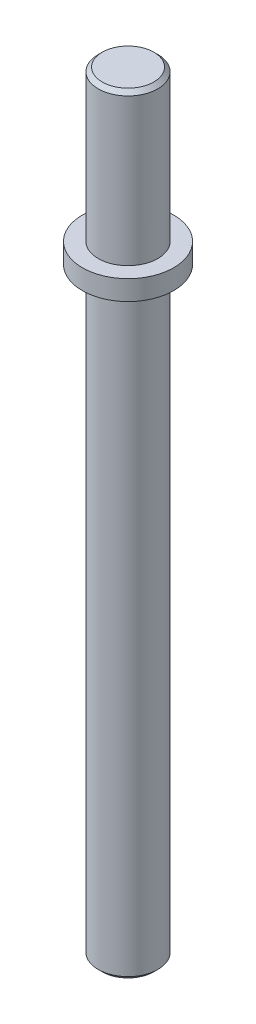
ISO-10303-21;
HEADER;
FILE_DESCRIPTION(('STEP AP214'),'2;1');
FILE_NAME('part.step','',(''),(''),'','','');
FILE_SCHEMA(('AUTOMOTIVE_DESIGN { 1 0 10303 214 1 1 1 1 }'));
ENDSEC;
DATA;
#1=APPLICATION_CONTEXT('core data for automotive mechanical design processes');
#2=APPLICATION_PROTOCOL_DEFINITION('international standard','automotive_design',2000,#1);
#3=PRODUCT_CONTEXT('',#1,'mechanical');
#4=PRODUCT('Part','Part','',(#3));
#5=PRODUCT_RELATED_PRODUCT_CATEGORY('part','',(#4));
#6=PRODUCT_DEFINITION_FORMATION('','',#4);
#7=PRODUCT_DEFINITION_CONTEXT('part definition',#1,'design');
#8=PRODUCT_DEFINITION('design','',#6,#7);
#9=PRODUCT_DEFINITION_SHAPE('','',#8);
#10=(LENGTH_UNIT() NAMED_UNIT(*) SI_UNIT(.MILLI.,.METRE.));
#11=(NAMED_UNIT(*) PLANE_ANGLE_UNIT() SI_UNIT($,.RADIAN.));
#12=(NAMED_UNIT(*) SI_UNIT($,.STERADIAN.) SOLID_ANGLE_UNIT());
#13=UNCERTAINTY_MEASURE_WITH_UNIT(LENGTH_MEASURE(1.E-05),#10,'distance_accuracy_value','');
#14=(GEOMETRIC_REPRESENTATION_CONTEXT(3) GLOBAL_UNCERTAINTY_ASSIGNED_CONTEXT((#13)) GLOBAL_UNIT_ASSIGNED_CONTEXT((#10,
#11,#12)) REPRESENTATION_CONTEXT('',''));
#15=CARTESIAN_POINT('',(0.,0.,0.));
#16=DIRECTION('',(0.,0.,1.));
#17=DIRECTION('',(1.,0.,0.));
#18=AXIS2_PLACEMENT_3D('',#15,#16,#17);
#19=CARTESIAN_POINT('',(0.,-35.306,0.));
#20=DIRECTION('',(0.,-1.,0.));
#21=DIRECTION('',(0.,0.,-1.));
#22=AXIS2_PLACEMENT_3D('',#19,#20,#21);
#23=PLANE('',#22);
#24=CARTESIAN_POINT('',(0.,-35.306,0.));
#25=DIRECTION('',(0.,-1.,0.));
#26=DIRECTION('',(0.,0.,-1.));
#27=AXIS2_PLACEMENT_3D('',#24,#25,#26);
#28=CIRCLE('',#27,1.65100000000001);
#29=CARTESIAN_POINT('',(0.,-35.306,-1.65100000000001));
#30=VERTEX_POINT('',#29);
#31=EDGE_CURVE('E47',#30,#30,#28,.T.);
#32=ORIENTED_EDGE('',*,*,#31,.T.);
#33=EDGE_LOOP('',(#32));
#34=FACE_BOUND('',#33,.T.);
#35=ADVANCED_FACE('F32',(#34),#23,.T.);
#36=CARTESIAN_POINT('',(0.,0.,0.));
#37=DIRECTION('',(0.,-1.,0.));
#38=DIRECTION('',(0.,0.,-1.));
#39=AXIS2_PLACEMENT_3D('',#36,#37,#38);
#40=CYLINDRICAL_SURFACE('',#39,1.905);
#41=CARTESIAN_POINT('',(0.,-35.052,0.));
#42=DIRECTION('',(0.,-1.,0.));
#43=DIRECTION('',(0.,0.,-1.));
#44=AXIS2_PLACEMENT_3D('',#41,#42,#43);
#45=CIRCLE('',#44,1.905);
#46=CARTESIAN_POINT('',(0.,-35.052,-1.905));
#47=VERTEX_POINT('',#46);
#48=EDGE_CURVE('E43',#47,#47,#45,.F.);
#49=ORIENTED_EDGE('',*,*,#48,.T.);
#50=EDGE_LOOP('',(#49));
#51=FACE_BOUND('',#50,.T.);
#52=CARTESIAN_POINT('',(0.,3.048,0.));
#53=DIRECTION('',(0.,-1.,0.));
#54=DIRECTION('',(0.,0.,-1.));
#55=AXIS2_PLACEMENT_3D('',#52,#53,#54);
#56=CIRCLE('',#55,1.905);
#57=CARTESIAN_POINT('',(0.,3.048,-1.905));
#58=VERTEX_POINT('',#57);
#59=EDGE_CURVE('E52',#58,#58,#56,.T.);
#60=ORIENTED_EDGE('',*,*,#59,.T.);
#61=EDGE_LOOP('',(#60));
#62=FACE_BOUND('',#61,.T.);
#63=ADVANCED_FACE('F81',(#51,#62),#40,.T.);
#64=CARTESIAN_POINT('',(1.905,3.048,0.));
#65=DIRECTION('',(0.,-1.,0.));
#66=DIRECTION('',(0.,0.,-1.));
#67=AXIS2_PLACEMENT_3D('',#64,#65,#66);
#68=PLANE('',#67);
#69=CARTESIAN_POINT('',(0.,3.048,0.));
#70=DIRECTION('',(0.,-1.,0.));
#71=DIRECTION('',(0.,0.,-1.));
#72=AXIS2_PLACEMENT_3D('',#69,#70,#71);
#73=CIRCLE('',#72,2.921);
#74=CARTESIAN_POINT('',(0.,3.048,-2.921));
#75=VERTEX_POINT('',#74);
#76=EDGE_CURVE('E55',#75,#75,#73,.T.);
#77=ORIENTED_EDGE('',*,*,#76,.T.);
#78=EDGE_LOOP('',(#77));
#79=FACE_BOUND('',#78,.T.);
#80=ORIENTED_EDGE('',*,*,#59,.F.);
#81=EDGE_LOOP('',(#80));
#82=FACE_BOUND('',#81,.T.);
#83=ADVANCED_FACE('F87',(#79,#82),#68,.T.);
#84=CARTESIAN_POINT('',(0.,0.,0.));
#85=DIRECTION('',(0.,-1.,0.));
#86=DIRECTION('',(0.,0.,-1.));
#87=AXIS2_PLACEMENT_3D('',#84,#85,#86);
#88=CYLINDRICAL_SURFACE('',#87,2.921);
#89=CARTESIAN_POINT('',(0.,4.318,0.));
#90=DIRECTION('',(0.,-1.,0.));
#91=DIRECTION('',(0.,0.,-1.));
#92=AXIS2_PLACEMENT_3D('',#89,#90,#91);
#93=CIRCLE('',#92,2.921);
#94=CARTESIAN_POINT('',(0.,4.318,-2.921));
#95=VERTEX_POINT('',#94);
#96=EDGE_CURVE('E58',#95,#95,#93,.T.);
#97=ORIENTED_EDGE('',*,*,#96,.T.);
#98=EDGE_LOOP('',(#97));
#99=FACE_BOUND('',#98,.T.);
#100=ORIENTED_EDGE('',*,*,#76,.F.);
#101=EDGE_LOOP('',(#100));
#102=FACE_BOUND('',#101,.T.);
#103=ADVANCED_FACE('F78',(#99,#102),#88,.T.);
#104=CARTESIAN_POINT('',(1.905,4.318,0.));
#105=DIRECTION('',(0.,1.,0.));
#106=DIRECTION('',(0.,0.,1.));
#107=AXIS2_PLACEMENT_3D('',#104,#105,#106);
#108=PLANE('',#107);
#109=CARTESIAN_POINT('',(0.,4.318,0.));
#110=DIRECTION('',(0.,-1.,0.));
#111=DIRECTION('',(0.,0.,-1.));
#112=AXIS2_PLACEMENT_3D('',#109,#110,#111);
#113=CIRCLE('',#112,1.905);
#114=CARTESIAN_POINT('',(0.,4.318,-1.905));
#115=VERTEX_POINT('',#114);
#116=EDGE_CURVE('E61',#115,#115,#113,.T.);
#117=ORIENTED_EDGE('',*,*,#116,.T.);
#118=EDGE_LOOP('',(#117));
#119=FACE_BOUND('',#118,.T.);
#120=ORIENTED_EDGE('',*,*,#96,.F.);
#121=EDGE_LOOP('',(#120));
#122=FACE_BOUND('',#121,.T.);
#123=ADVANCED_FACE('F65',(#119,#122),#108,.T.);
#124=CARTESIAN_POINT('',(0.,0.,0.));
#125=DIRECTION('',(0.,-1.,0.));
#126=DIRECTION('',(0.,0.,-1.));
#127=AXIS2_PLACEMENT_3D('',#124,#125,#126);
#128=CYLINDRICAL_SURFACE('',#127,1.905);
#129=CARTESIAN_POINT('',(0.,13.716,0.));
#130=DIRECTION('',(0.,1.,0.));
#131=DIRECTION('',(0.,0.,1.));
#132=AXIS2_PLACEMENT_3D('',#129,#130,#131);
#133=CIRCLE('',#132,1.905);
#134=CARTESIAN_POINT('',(0.,13.716,1.905));
#135=VERTEX_POINT('',#134);
#136=EDGE_CURVE('E39',#135,#135,#133,.F.);
#137=ORIENTED_EDGE('',*,*,#136,.T.);
#138=EDGE_LOOP('',(#137));
#139=FACE_BOUND('',#138,.T.);
#140=ORIENTED_EDGE('',*,*,#116,.F.);
#141=EDGE_LOOP('',(#140));
#142=FACE_BOUND('',#141,.T.);
#143=ADVANCED_FACE('F68',(#139,#142),#128,.T.);
#144=CARTESIAN_POINT('',(0.,13.97,0.));
#145=DIRECTION('',(0.,1.,0.));
#146=DIRECTION('',(0.,0.,1.));
#147=AXIS2_PLACEMENT_3D('',#144,#145,#146);
#148=PLANE('',#147);
#149=CARTESIAN_POINT('',(0.,13.97,0.));
#150=DIRECTION('',(0.,1.,0.));
#151=DIRECTION('',(0.,0.,1.));
#152=AXIS2_PLACEMENT_3D('',#149,#150,#151);
#153=CIRCLE('',#152,1.65099999999999);
#154=CARTESIAN_POINT('',(0.,13.97,1.65099999999999));
#155=VERTEX_POINT('',#154);
#156=EDGE_CURVE('E10',#155,#155,#153,.T.);
#157=ORIENTED_EDGE('',*,*,#156,.T.);
#158=EDGE_LOOP('',(#157));
#159=FACE_BOUND('',#158,.T.);
#160=ADVANCED_FACE('F70',(#159),#148,.T.);
#161=CARTESIAN_POINT('',(0.,-35.306,0.));
#162=DIRECTION('',(0.,1.,0.));
#163=DIRECTION('',(0.,0.,1.));
#164=AXIS2_PLACEMENT_3D('',#161,#162,#163);
#165=CONICAL_SURFACE('',#164,1.65100000000001,0.785398163397436);
#166=ORIENTED_EDGE('',*,*,#48,.F.);
#167=EDGE_LOOP('',(#166));
#168=FACE_BOUND('',#167,.T.);
#169=ORIENTED_EDGE('',*,*,#31,.F.);
#170=EDGE_LOOP('',(#169));
#171=FACE_BOUND('',#170,.T.);
#172=ADVANCED_FACE('F76',(#168,#171),#165,.T.);
#173=CARTESIAN_POINT('',(0.,13.716,0.));
#174=DIRECTION('',(0.,-1.,0.));
#175=DIRECTION('',(0.,0.,-1.));
#176=AXIS2_PLACEMENT_3D('',#173,#174,#175);
#177=CONICAL_SURFACE('',#176,1.905,0.785398163397445);
#178=ORIENTED_EDGE('',*,*,#156,.F.);
#179=EDGE_LOOP('',(#178));
#180=FACE_BOUND('',#179,.T.);
#181=ORIENTED_EDGE('',*,*,#136,.F.);
#182=EDGE_LOOP('',(#181));
#183=FACE_BOUND('',#182,.T.);
#184=ADVANCED_FACE('F34',(#180,#183),#177,.T.);
#185=CLOSED_SHELL('',(#35,#63,#83,#103,#123,#143,#160,#172,#184));
#186=MANIFOLD_SOLID_BREP('B2',#185);
#187=ADVANCED_BREP_SHAPE_REPRESENTATION('',(#18,#186),#14);
#188=SHAPE_DEFINITION_REPRESENTATION(#9,#187);
ENDSEC;
END-ISO-10303-21;
